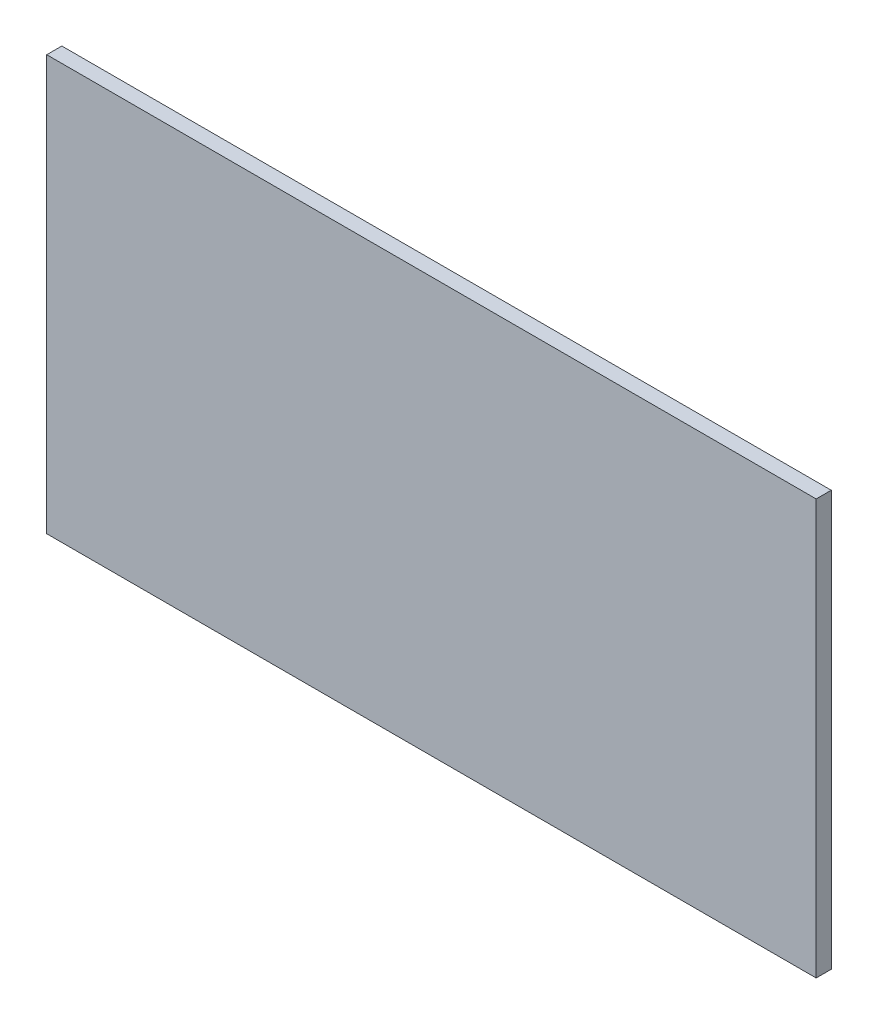
ISO-10303-21;
HEADER;
FILE_DESCRIPTION(('STEP AP214'),'2;1');
FILE_NAME('part.step','',(''),(''),'','','');
FILE_SCHEMA(('AUTOMOTIVE_DESIGN { 1 0 10303 214 1 1 1 1 }'));
ENDSEC;
DATA;
#1=APPLICATION_CONTEXT('core data for automotive mechanical design processes');
#2=APPLICATION_PROTOCOL_DEFINITION('international standard','automotive_design',2000,#1);
#3=PRODUCT_CONTEXT('',#1,'mechanical');
#4=PRODUCT('Part','Part','',(#3));
#5=PRODUCT_RELATED_PRODUCT_CATEGORY('part','',(#4));
#6=PRODUCT_DEFINITION_FORMATION('','',#4);
#7=PRODUCT_DEFINITION_CONTEXT('part definition',#1,'design');
#8=PRODUCT_DEFINITION('design','',#6,#7);
#9=PRODUCT_DEFINITION_SHAPE('','',#8);
#10=(LENGTH_UNIT() NAMED_UNIT(*) SI_UNIT(.MILLI.,.METRE.));
#11=(NAMED_UNIT(*) PLANE_ANGLE_UNIT() SI_UNIT($,.RADIAN.));
#12=(NAMED_UNIT(*) SI_UNIT($,.STERADIAN.) SOLID_ANGLE_UNIT());
#13=UNCERTAINTY_MEASURE_WITH_UNIT(LENGTH_MEASURE(1.E-05),#10,'distance_accuracy_value','');
#14=(GEOMETRIC_REPRESENTATION_CONTEXT(3) GLOBAL_UNCERTAINTY_ASSIGNED_CONTEXT((#13)) GLOBAL_UNIT_ASSIGNED_CONTEXT((#10,
#11,#12)) REPRESENTATION_CONTEXT('',''));
#15=CARTESIAN_POINT('',(0.,0.,0.));
#16=DIRECTION('',(0.,0.,1.));
#17=DIRECTION('',(1.,0.,0.));
#18=AXIS2_PLACEMENT_3D('',#15,#16,#17);
#19=CARTESIAN_POINT('',(255.,-137.5,10.));
#20=DIRECTION('',(-1.,0.,0.));
#21=DIRECTION('',(0.,0.,1.));
#22=AXIS2_PLACEMENT_3D('',#19,#20,#21);
#23=PLANE('',#22);
#24=DIRECTION('',(0.,1.,0.));
#25=VECTOR('',#24,1.);
#26=CARTESIAN_POINT('',(255.,-137.5,0.));
#27=LINE('',#26,#25);
#28=CARTESIAN_POINT('',(255.,-137.5,0.));
#29=VERTEX_POINT('',#28);
#30=CARTESIAN_POINT('',(255.,137.5,0.));
#31=VERTEX_POINT('',#30);
#32=EDGE_CURVE('E96',#29,#31,#27,.T.);
#33=ORIENTED_EDGE('',*,*,#32,.T.);
#34=DIRECTION('',(0.,0.,-1.));
#35=VECTOR('',#34,1.);
#36=CARTESIAN_POINT('',(255.,137.5,10.));
#37=LINE('',#36,#35);
#38=CARTESIAN_POINT('',(255.,137.5,10.));
#39=VERTEX_POINT('',#38);
#40=EDGE_CURVE('E11',#39,#31,#37,.T.);
#41=ORIENTED_EDGE('',*,*,#40,.F.);
#42=DIRECTION('',(0.,1.,0.));
#43=VECTOR('',#42,1.);
#44=CARTESIAN_POINT('',(255.,-137.5,10.));
#45=LINE('',#44,#43);
#46=CARTESIAN_POINT('',(255.,-137.5,10.));
#47=VERTEX_POINT('',#46);
#48=EDGE_CURVE('E84',#47,#39,#45,.T.);
#49=ORIENTED_EDGE('',*,*,#48,.F.);
#50=DIRECTION('',(0.,0.,-1.));
#51=VECTOR('',#50,1.);
#52=CARTESIAN_POINT('',(255.,-137.5,10.));
#53=LINE('',#52,#51);
#54=EDGE_CURVE('E92',#47,#29,#53,.T.);
#55=ORIENTED_EDGE('',*,*,#54,.T.);
#56=EDGE_LOOP('',(#33,#41,#49,#55));
#57=FACE_BOUND('',#56,.T.);
#58=ADVANCED_FACE('F33',(#57),#23,.F.);
#59=CARTESIAN_POINT('',(-255.,137.5,10.));
#60=DIRECTION('',(0.,-1.,0.));
#61=DIRECTION('',(0.,0.,-1.));
#62=AXIS2_PLACEMENT_3D('',#59,#60,#61);
#63=PLANE('',#62);
#64=DIRECTION('',(-1.,0.,0.));
#65=VECTOR('',#64,1.);
#66=CARTESIAN_POINT('',(-255.,137.5,0.));
#67=LINE('',#66,#65);
#68=CARTESIAN_POINT('',(-255.,137.5,0.));
#69=VERTEX_POINT('',#68);
#70=EDGE_CURVE('E88',#31,#69,#67,.T.);
#71=ORIENTED_EDGE('',*,*,#70,.T.);
#72=DIRECTION('',(0.,0.,-1.));
#73=VECTOR('',#72,1.);
#74=CARTESIAN_POINT('',(-255.,137.5,10.));
#75=LINE('',#74,#73);
#76=CARTESIAN_POINT('',(-255.,137.5,10.));
#77=VERTEX_POINT('',#76);
#78=EDGE_CURVE('E41',#77,#69,#75,.T.);
#79=ORIENTED_EDGE('',*,*,#78,.F.);
#80=DIRECTION('',(-1.,0.,0.));
#81=VECTOR('',#80,1.);
#82=CARTESIAN_POINT('',(-255.,137.5,10.));
#83=LINE('',#82,#81);
#84=EDGE_CURVE('E79',#39,#77,#83,.T.);
#85=ORIENTED_EDGE('',*,*,#84,.F.);
#86=ORIENTED_EDGE('',*,*,#40,.T.);
#87=EDGE_LOOP('',(#71,#79,#85,#86));
#88=FACE_BOUND('',#87,.T.);
#89=ADVANCED_FACE('F87',(#88),#63,.F.);
#90=CARTESIAN_POINT('',(-255.,-137.5,10.));
#91=DIRECTION('',(1.,0.,0.));
#92=DIRECTION('',(0.,0.,-1.));
#93=AXIS2_PLACEMENT_3D('',#90,#91,#92);
#94=PLANE('',#93);
#95=DIRECTION('',(0.,-1.,0.));
#96=VECTOR('',#95,1.);
#97=CARTESIAN_POINT('',(-255.,-137.5,0.));
#98=LINE('',#97,#96);
#99=CARTESIAN_POINT('',(-255.,-137.5,0.));
#100=VERTEX_POINT('',#99);
#101=EDGE_CURVE('E66',#69,#100,#98,.T.);
#102=ORIENTED_EDGE('',*,*,#101,.T.);
#103=DIRECTION('',(0.,0.,-1.));
#104=VECTOR('',#103,1.);
#105=CARTESIAN_POINT('',(-255.,-137.5,10.));
#106=LINE('',#105,#104);
#107=CARTESIAN_POINT('',(-255.,-137.5,10.));
#108=VERTEX_POINT('',#107);
#109=EDGE_CURVE('E89',#108,#100,#106,.T.);
#110=ORIENTED_EDGE('',*,*,#109,.F.);
#111=DIRECTION('',(0.,-1.,0.));
#112=VECTOR('',#111,1.);
#113=CARTESIAN_POINT('',(-255.,-137.5,10.));
#114=LINE('',#113,#112);
#115=EDGE_CURVE('E82',#77,#108,#114,.T.);
#116=ORIENTED_EDGE('',*,*,#115,.F.);
#117=ORIENTED_EDGE('',*,*,#78,.T.);
#118=EDGE_LOOP('',(#102,#110,#116,#117));
#119=FACE_BOUND('',#118,.T.);
#120=ADVANCED_FACE('F90',(#119),#94,.F.);
#121=CARTESIAN_POINT('',(-255.,-137.5,10.));
#122=DIRECTION('',(0.,1.,0.));
#123=DIRECTION('',(0.,0.,1.));
#124=AXIS2_PLACEMENT_3D('',#121,#122,#123);
#125=PLANE('',#124);
#126=DIRECTION('',(1.,0.,0.));
#127=VECTOR('',#126,1.);
#128=CARTESIAN_POINT('',(-255.,-137.5,0.));
#129=LINE('',#128,#127);
#130=EDGE_CURVE('E72',#100,#29,#129,.T.);
#131=ORIENTED_EDGE('',*,*,#130,.T.);
#132=ORIENTED_EDGE('',*,*,#54,.F.);
#133=DIRECTION('',(1.,0.,0.));
#134=VECTOR('',#133,1.);
#135=CARTESIAN_POINT('',(-255.,-137.5,10.));
#136=LINE('',#135,#134);
#137=EDGE_CURVE('E49',#108,#47,#136,.T.);
#138=ORIENTED_EDGE('',*,*,#137,.F.);
#139=ORIENTED_EDGE('',*,*,#109,.T.);
#140=EDGE_LOOP('',(#131,#132,#138,#139));
#141=FACE_BOUND('',#140,.T.);
#142=ADVANCED_FACE('F103',(#141),#125,.F.);
#143=CARTESIAN_POINT('',(0.,0.,10.));
#144=DIRECTION('',(0.,0.,-1.));
#145=DIRECTION('',(-1.,0.,0.));
#146=AXIS2_PLACEMENT_3D('',#143,#144,#145);
#147=PLANE('',#146);
#148=ORIENTED_EDGE('',*,*,#48,.T.);
#149=ORIENTED_EDGE('',*,*,#84,.T.);
#150=ORIENTED_EDGE('',*,*,#115,.T.);
#151=ORIENTED_EDGE('',*,*,#137,.T.);
#152=EDGE_LOOP('',(#148,#149,#150,#151));
#153=FACE_BOUND('',#152,.T.);
#154=ADVANCED_FACE('F80',(#153),#147,.F.);
#155=CARTESIAN_POINT('',(0.,0.,0.));
#156=DIRECTION('',(0.,0.,-1.));
#157=DIRECTION('',(-1.,0.,0.));
#158=AXIS2_PLACEMENT_3D('',#155,#156,#157);
#159=PLANE('',#158);
#160=ORIENTED_EDGE('',*,*,#32,.F.);
#161=ORIENTED_EDGE('',*,*,#130,.F.);
#162=ORIENTED_EDGE('',*,*,#101,.F.);
#163=ORIENTED_EDGE('',*,*,#70,.F.);
#164=EDGE_LOOP('',(#160,#161,#162,#163));
#165=FACE_BOUND('',#164,.T.);
#166=ADVANCED_FACE('F106',(#165),#159,.T.);
#167=CLOSED_SHELL('',(#58,#89,#120,#142,#154,#166));
#168=MANIFOLD_SOLID_BREP('B2',#167);
#169=ADVANCED_BREP_SHAPE_REPRESENTATION('',(#18,#168),#14);
#170=SHAPE_DEFINITION_REPRESENTATION(#9,#169);
ENDSEC;
END-ISO-10303-21;
